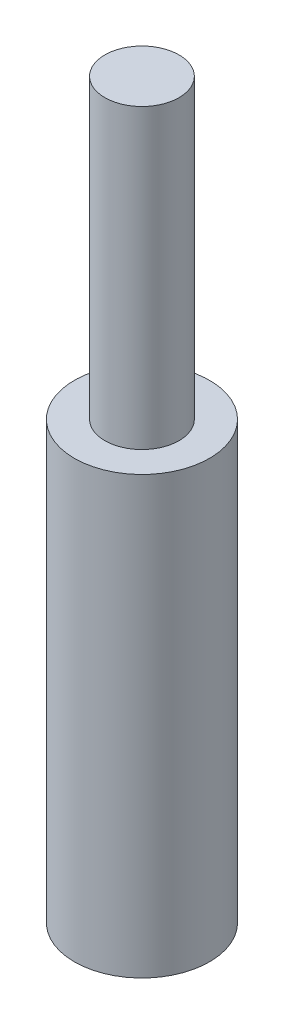
ISO-10303-21;
HEADER;
FILE_DESCRIPTION(('STEP AP214'),'2;1');
FILE_NAME('part.step','',(''),(''),'','','');
FILE_SCHEMA(('AUTOMOTIVE_DESIGN { 1 0 10303 214 1 1 1 1 }'));
ENDSEC;
DATA;
#1=APPLICATION_CONTEXT('core data for automotive mechanical design processes');
#2=APPLICATION_PROTOCOL_DEFINITION('international standard','automotive_design',2000,#1);
#3=PRODUCT_CONTEXT('',#1,'mechanical');
#4=PRODUCT('Part','Part','',(#3));
#5=PRODUCT_RELATED_PRODUCT_CATEGORY('part','',(#4));
#6=PRODUCT_DEFINITION_FORMATION('','',#4);
#7=PRODUCT_DEFINITION_CONTEXT('part definition',#1,'design');
#8=PRODUCT_DEFINITION('design','',#6,#7);
#9=PRODUCT_DEFINITION_SHAPE('','',#8);
#10=(LENGTH_UNIT() NAMED_UNIT(*) SI_UNIT(.MILLI.,.METRE.));
#11=(NAMED_UNIT(*) PLANE_ANGLE_UNIT() SI_UNIT($,.RADIAN.));
#12=(NAMED_UNIT(*) SI_UNIT($,.STERADIAN.) SOLID_ANGLE_UNIT());
#13=UNCERTAINTY_MEASURE_WITH_UNIT(LENGTH_MEASURE(1.E-05),#10,'distance_accuracy_value','');
#14=(GEOMETRIC_REPRESENTATION_CONTEXT(3) GLOBAL_UNCERTAINTY_ASSIGNED_CONTEXT((#13)) GLOBAL_UNIT_ASSIGNED_CONTEXT((#10,
#11,#12)) REPRESENTATION_CONTEXT('',''));
#15=CARTESIAN_POINT('',(0.,0.,0.));
#16=DIRECTION('',(0.,0.,1.));
#17=DIRECTION('',(1.,0.,0.));
#18=AXIS2_PLACEMENT_3D('',#15,#16,#17);
#19=CARTESIAN_POINT('',(0.,10.,0.));
#20=DIRECTION('',(0.,-1.,0.));
#21=DIRECTION('',(0.,0.,-1.));
#22=AXIS2_PLACEMENT_3D('',#19,#20,#21);
#23=CYLINDRICAL_SURFACE('',#22,1.55);
#24=CARTESIAN_POINT('',(0.,10.,0.));
#25=DIRECTION('',(0.,1.,0.));
#26=DIRECTION('',(0.,0.,1.));
#27=AXIS2_PLACEMENT_3D('',#24,#25,#26);
#28=CIRCLE('',#27,1.55);
#29=CARTESIAN_POINT('',(0.,10.,1.55));
#30=VERTEX_POINT('',#29);
#31=EDGE_CURVE('E46',#30,#30,#28,.T.);
#32=ORIENTED_EDGE('',*,*,#31,.F.);
#33=EDGE_LOOP('',(#32));
#34=FACE_BOUND('',#33,.T.);
#35=CARTESIAN_POINT('',(0.,0.,0.));
#36=DIRECTION('',(0.,1.,0.));
#37=DIRECTION('',(0.,0.,1.));
#38=AXIS2_PLACEMENT_3D('',#35,#36,#37);
#39=CIRCLE('',#38,1.55);
#40=CARTESIAN_POINT('',(0.,0.,1.55));
#41=VERTEX_POINT('',#40);
#42=EDGE_CURVE('E42',#41,#41,#39,.T.);
#43=ORIENTED_EDGE('',*,*,#42,.T.);
#44=EDGE_LOOP('',(#43));
#45=FACE_BOUND('',#44,.T.);
#46=ADVANCED_FACE('F39',(#34,#45),#23,.T.);
#47=CARTESIAN_POINT('',(0.,10.,0.));
#48=DIRECTION('',(0.,1.,0.));
#49=DIRECTION('',(0.,0.,1.));
#50=AXIS2_PLACEMENT_3D('',#47,#48,#49);
#51=PLANE('',#50);
#52=CARTESIAN_POINT('',(0.,10.,0.));
#53=DIRECTION('',(0.,1.,0.));
#54=DIRECTION('',(0.,0.,1.));
#55=AXIS2_PLACEMENT_3D('',#52,#53,#54);
#56=CIRCLE('',#55,0.85);
#57=CARTESIAN_POINT('',(0.,10.,0.85));
#58=VERTEX_POINT('',#57);
#59=EDGE_CURVE('E10',#58,#58,#56,.T.);
#60=ORIENTED_EDGE('',*,*,#59,.F.);
#61=EDGE_LOOP('',(#60));
#62=FACE_BOUND('',#61,.T.);
#63=ORIENTED_EDGE('',*,*,#31,.T.);
#64=EDGE_LOOP('',(#63));
#65=FACE_BOUND('',#64,.T.);
#66=ADVANCED_FACE('F63',(#62,#65),#51,.T.);
#67=CARTESIAN_POINT('',(0.,0.,0.));
#68=DIRECTION('',(0.,1.,0.));
#69=DIRECTION('',(0.,0.,1.));
#70=AXIS2_PLACEMENT_3D('',#67,#68,#69);
#71=PLANE('',#70);
#72=ORIENTED_EDGE('',*,*,#42,.F.);
#73=EDGE_LOOP('',(#72));
#74=FACE_BOUND('',#73,.T.);
#75=ADVANCED_FACE('F60',(#74),#71,.F.);
#76=CARTESIAN_POINT('',(0.,16.8128592366714,0.));
#77=DIRECTION('',(0.,-1.,0.));
#78=DIRECTION('',(0.,0.,-1.));
#79=AXIS2_PLACEMENT_3D('',#76,#77,#78);
#80=CYLINDRICAL_SURFACE('',#79,0.85);
#81=CARTESIAN_POINT('',(0.,16.8128592366714,0.));
#82=DIRECTION('',(0.,1.,0.));
#83=DIRECTION('',(0.,0.,1.));
#84=AXIS2_PLACEMENT_3D('',#81,#82,#83);
#85=CIRCLE('',#84,0.85);
#86=CARTESIAN_POINT('',(0.,16.8128592366714,0.85));
#87=VERTEX_POINT('',#86);
#88=EDGE_CURVE('E52',#87,#87,#85,.T.);
#89=ORIENTED_EDGE('',*,*,#88,.F.);
#90=EDGE_LOOP('',(#89));
#91=FACE_BOUND('',#90,.T.);
#92=ORIENTED_EDGE('',*,*,#59,.T.);
#93=EDGE_LOOP('',(#92));
#94=FACE_BOUND('',#93,.T.);
#95=ADVANCED_FACE('F62',(#91,#94),#80,.T.);
#96=CARTESIAN_POINT('',(0.,16.8128592366714,0.));
#97=DIRECTION('',(0.,1.,0.));
#98=DIRECTION('',(0.,0.,1.));
#99=AXIS2_PLACEMENT_3D('',#96,#97,#98);
#100=PLANE('',#99);
#101=ORIENTED_EDGE('',*,*,#88,.T.);
#102=EDGE_LOOP('',(#101));
#103=FACE_BOUND('',#102,.T.);
#104=ADVANCED_FACE('F68',(#103),#100,.T.);
#105=CLOSED_SHELL('',(#46,#66,#75,#95,#104));
#106=MANIFOLD_SOLID_BREP('B2',#105);
#107=ADVANCED_BREP_SHAPE_REPRESENTATION('',(#18,#106),#14);
#108=SHAPE_DEFINITION_REPRESENTATION(#9,#107);
ENDSEC;
END-ISO-10303-21;
